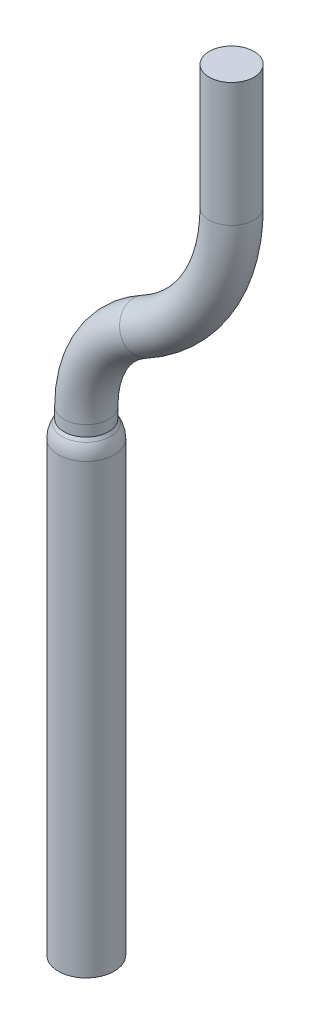
ISO-10303-21;
HEADER;
FILE_DESCRIPTION(('STEP AP214'),'2;1');
FILE_NAME('part.step','',(''),(''),'','','');
FILE_SCHEMA(('AUTOMOTIVE_DESIGN { 1 0 10303 214 1 1 1 1 }'));
ENDSEC;
DATA;
#1=APPLICATION_CONTEXT('core data for automotive mechanical design processes');
#2=APPLICATION_PROTOCOL_DEFINITION('international standard','automotive_design',2000,#1);
#3=PRODUCT_CONTEXT('',#1,'mechanical');
#4=PRODUCT('Part','Part','',(#3));
#5=PRODUCT_RELATED_PRODUCT_CATEGORY('part','',(#4));
#6=PRODUCT_DEFINITION_FORMATION('','',#4);
#7=PRODUCT_DEFINITION_CONTEXT('part definition',#1,'design');
#8=PRODUCT_DEFINITION('design','',#6,#7);
#9=PRODUCT_DEFINITION_SHAPE('','',#8);
#10=(LENGTH_UNIT() NAMED_UNIT(*) SI_UNIT(.MILLI.,.METRE.));
#11=(NAMED_UNIT(*) PLANE_ANGLE_UNIT() SI_UNIT($,.RADIAN.));
#12=(NAMED_UNIT(*) SI_UNIT($,.STERADIAN.) SOLID_ANGLE_UNIT());
#13=UNCERTAINTY_MEASURE_WITH_UNIT(LENGTH_MEASURE(1.E-05),#10,'distance_accuracy_value','');
#14=(GEOMETRIC_REPRESENTATION_CONTEXT(3) GLOBAL_UNCERTAINTY_ASSIGNED_CONTEXT((#13)) GLOBAL_UNIT_ASSIGNED_CONTEXT((#10,
#11,#12)) REPRESENTATION_CONTEXT('',''));
#15=CARTESIAN_POINT('',(0.,0.,0.));
#16=DIRECTION('',(0.,0.,1.));
#17=DIRECTION('',(1.,0.,0.));
#18=AXIS2_PLACEMENT_3D('',#15,#16,#17);
#19=CARTESIAN_POINT('',(-12.7,17.,0.));
#20=DIRECTION('',(0.,-1.,0.));
#21=DIRECTION('',(0.,0.,-1.));
#22=AXIS2_PLACEMENT_3D('',#19,#20,#21);
#23=CYLINDRICAL_SURFACE('',#22,0.800000000000001);
#24=CARTESIAN_POINT('',(-12.7,17.,0.));
#25=DIRECTION('',(0.,1.,0.));
#26=DIRECTION('',(0.,0.,1.));
#27=AXIS2_PLACEMENT_3D('',#24,#25,#26);
#28=CIRCLE('',#27,0.800000000000001);
#29=CARTESIAN_POINT('',(-12.7,17.,0.800000000000001));
#30=VERTEX_POINT('',#29);
#31=EDGE_CURVE('E50',#30,#30,#28,.T.);
#32=ORIENTED_EDGE('',*,*,#31,.F.);
#33=EDGE_LOOP('',(#32));
#34=FACE_BOUND('',#33,.T.);
#35=CARTESIAN_POINT('',(-12.7,16.6143593539449,0.));
#36=DIRECTION('',(0.,-1.,0.));
#37=DIRECTION('',(1.,0.,0.));
#38=AXIS2_PLACEMENT_3D('',#35,#36,#37);
#39=CIRCLE('',#38,0.800000000000001);
#40=CARTESIAN_POINT('',(-11.9,16.6143593539449,0.));
#41=VERTEX_POINT('',#40);
#42=EDGE_CURVE('E10',#41,#41,#39,.T.);
#43=ORIENTED_EDGE('',*,*,#42,.F.);
#44=EDGE_LOOP('',(#43));
#45=FACE_BOUND('',#44,.T.);
#46=ADVANCED_FACE('F30',(#34,#45),#23,.T.);
#47=CARTESIAN_POINT('',(-7.5,25.7726848797845,0.));
#48=DIRECTION('',(0.,1.,0.));
#49=DIRECTION('',(-1.,0.,0.));
#50=AXIS2_PLACEMENT_3D('',#47,#48,#49);
#51=CYLINDRICAL_SURFACE('',#50,0.800000000000001);
#52=CARTESIAN_POINT('',(-7.5,25.7726848797845,0.));
#53=DIRECTION('',(0.,1.,0.));
#54=DIRECTION('',(0.,0.,1.));
#55=AXIS2_PLACEMENT_3D('',#52,#53,#54);
#56=CIRCLE('',#55,0.800000000000001);
#57=CARTESIAN_POINT('',(-6.7,25.7726848797845,0.));
#58=VERTEX_POINT('',#57);
#59=EDGE_CURVE('E41',#58,#58,#56,.T.);
#60=ORIENTED_EDGE('',*,*,#59,.T.);
#61=EDGE_LOOP('',(#60));
#62=FACE_BOUND('',#61,.T.);
#63=CARTESIAN_POINT('',(-7.50000000000001,30.2,0.));
#64=DIRECTION('',(0.,1.,0.));
#65=DIRECTION('',(0.,0.,1.));
#66=AXIS2_PLACEMENT_3D('',#63,#64,#65);
#67=CIRCLE('',#66,0.800000000000001);
#68=CARTESIAN_POINT('',(-7.50000000000001,30.2,0.800000000000001));
#69=VERTEX_POINT('',#68);
#70=EDGE_CURVE('E37',#69,#69,#67,.T.);
#71=ORIENTED_EDGE('',*,*,#70,.F.);
#72=EDGE_LOOP('',(#71));
#73=FACE_BOUND('',#72,.T.);
#74=ADVANCED_FACE('F32',(#62,#73),#51,.T.);
#75=CARTESIAN_POINT('',(-13.5,25.7726848797845,0.));
#76=DIRECTION('',(0.,0.,1.));
#77=DIRECTION('',(1.,0.,0.));
#78=AXIS2_PLACEMENT_3D('',#75,#76,#77);
#79=TOROIDAL_SURFACE('',#78,6.,0.800000000000001);
#80=CARTESIAN_POINT('',(-10.62,20.5090739519138,0.));
#81=DIRECTION('',(0.877268487978453,0.479999999999999,0.));
#82=DIRECTION('',(0.,0.,1.));
#83=AXIS2_PLACEMENT_3D('',#80,#81,#82);
#84=CIRCLE('',#83,0.800000000000001);
#85=CARTESIAN_POINT('',(-10.236,19.8072591615311,0.));
#86=VERTEX_POINT('',#85);
#87=EDGE_CURVE('E45',#86,#86,#84,.T.);
#88=CARTESIAN_POINT('',(-13.5,25.7726848797845,0.));
#89=DIRECTION('',(0.,0.,1.));
#90=DIRECTION('',(1.,0.,0.));
#91=AXIS2_PLACEMENT_3D('',#88,#89,#90);
#92=CIRCLE('',#91,6.8);
#93=EDGE_CURVE('',#86,#58,#92,.T.);
#94=ORIENTED_EDGE('',*,*,#87,.T.);
#95=ORIENTED_EDGE('',*,*,#59,.F.);
#96=ORIENTED_EDGE('',*,*,#93,.T.);
#97=ORIENTED_EDGE('',*,*,#93,.F.);
#98=EDGE_LOOP('',(#94,#96,#95,#97));
#99=FACE_BOUND('',#98,.T.);
#100=ADVANCED_FACE('F89',(#99),#79,.T.);
#101=CARTESIAN_POINT('',(-8.7,17.,0.));
#102=DIRECTION('',(0.,0.,-1.));
#103=DIRECTION('',(-1.,0.,0.));
#104=AXIS2_PLACEMENT_3D('',#101,#102,#103);
#105=TOROIDAL_SURFACE('',#104,4.,0.800000000000001);
#106=ORIENTED_EDGE('',*,*,#31,.T.);
#107=EDGE_LOOP('',(#106));
#108=FACE_BOUND('',#107,.T.);
#109=ORIENTED_EDGE('',*,*,#87,.F.);
#110=EDGE_LOOP('',(#109));
#111=FACE_BOUND('',#110,.T.);
#112=ADVANCED_FACE('F94',(#108,#111),#105,.T.);
#113=CARTESIAN_POINT('',(-7.50000000000001,30.2,0.));
#114=DIRECTION('',(0.,1.,0.));
#115=DIRECTION('',(0.,0.,1.));
#116=AXIS2_PLACEMENT_3D('',#113,#114,#115);
#117=PLANE('',#116);
#118=ORIENTED_EDGE('',*,*,#70,.T.);
#119=EDGE_LOOP('',(#118));
#120=FACE_BOUND('',#119,.T.);
#121=ADVANCED_FACE('F96',(#120),#117,.T.);
#122=CARTESIAN_POINT('',(-12.7,16.5,0.));
#123=DIRECTION('',(0.,-1.,0.));
#124=DIRECTION('',(1.,0.,0.));
#125=AXIS2_PLACEMENT_3D('',#122,#123,#124);
#126=CONICAL_SURFACE('',#125,0.866025403784443,0.5235987755983);
#127=CARTESIAN_POINT('',(-12.7,16.5,0.));
#128=DIRECTION('',(0.,1.,0.));
#129=DIRECTION('',(-1.,0.,0.));
#130=AXIS2_PLACEMENT_3D('',#127,#128,#129);
#131=CIRCLE('',#130,0.866025403784442);
#132=CARTESIAN_POINT('',(-13.5660254037844,16.5,0.));
#133=VERTEX_POINT('',#132);
#134=EDGE_CURVE('E59',#133,#133,#131,.T.);
#135=ORIENTED_EDGE('',*,*,#134,.T.);
#136=EDGE_LOOP('',(#135));
#137=FACE_BOUND('',#136,.T.);
#138=ORIENTED_EDGE('',*,*,#42,.T.);
#139=EDGE_LOOP('',(#138));
#140=FACE_BOUND('',#139,.T.);
#141=ADVANCED_FACE('F63',(#137,#140),#126,.T.);
#142=CARTESIAN_POINT('',(-12.7,21.8194232190393,0.));
#143=DIRECTION('',(0.,1.,0.));
#144=DIRECTION('',(-1.,0.,0.));
#145=AXIS2_PLACEMENT_3D('',#142,#143,#144);
#146=CYLINDRICAL_SURFACE('',#145,1.);
#147=CARTESIAN_POINT('',(-12.7,16.,0.));
#148=DIRECTION('',(0.,1.,0.));
#149=DIRECTION('',(-1.,0.,0.));
#150=AXIS2_PLACEMENT_3D('',#147,#148,#149);
#151=CIRCLE('',#150,1.);
#152=CARTESIAN_POINT('',(-13.7,16.,0.));
#153=VERTEX_POINT('',#152);
#154=EDGE_CURVE('E56',#153,#153,#151,.T.);
#155=ORIENTED_EDGE('',*,*,#154,.F.);
#156=EDGE_LOOP('',(#155));
#157=FACE_BOUND('',#156,.T.);
#158=CARTESIAN_POINT('',(-12.7,0.,0.));
#159=DIRECTION('',(0.,1.,0.));
#160=DIRECTION('',(-1.,0.,0.));
#161=AXIS2_PLACEMENT_3D('',#158,#159,#160);
#162=CIRCLE('',#161,1.);
#163=CARTESIAN_POINT('',(-13.7,0.,0.));
#164=VERTEX_POINT('',#163);
#165=EDGE_CURVE('E53',#164,#164,#162,.T.);
#166=ORIENTED_EDGE('',*,*,#165,.T.);
#167=EDGE_LOOP('',(#166));
#168=FACE_BOUND('',#167,.T.);
#169=ADVANCED_FACE('F69',(#157,#168),#146,.T.);
#170=CARTESIAN_POINT('',(-12.7,16.,0.));
#171=DIRECTION('',(0.,1.,0.));
#172=DIRECTION('',(1.,0.,0.));
#173=AXIS2_PLACEMENT_3D('',#170,#171,#172);
#174=SPHERICAL_SURFACE('',#173,1.);
#175=ORIENTED_EDGE('',*,*,#134,.F.);
#176=EDGE_LOOP('',(#175));
#177=FACE_BOUND('',#176,.T.);
#178=ORIENTED_EDGE('',*,*,#154,.T.);
#179=EDGE_LOOP('',(#178));
#180=FACE_BOUND('',#179,.T.);
#181=ADVANCED_FACE('F65',(#177,#180),#174,.T.);
#182=CARTESIAN_POINT('',(-12.7,0.,0.));
#183=DIRECTION('',(0.,1.,0.));
#184=DIRECTION('',(0.,0.,1.));
#185=AXIS2_PLACEMENT_3D('',#182,#183,#184);
#186=PLANE('',#185);
#187=ORIENTED_EDGE('',*,*,#165,.F.);
#188=EDGE_LOOP('',(#187));
#189=FACE_BOUND('',#188,.T.);
#190=ADVANCED_FACE('F68',(#189),#186,.F.);
#191=CLOSED_SHELL('',(#46,#74,#100,#112,#121,#141,#169,#181,#190));
#192=MANIFOLD_SOLID_BREP('B2',#191);
#193=ADVANCED_BREP_SHAPE_REPRESENTATION('',(#18,#192),#14);
#194=SHAPE_DEFINITION_REPRESENTATION(#9,#193);
ENDSEC;
END-ISO-10303-21;
